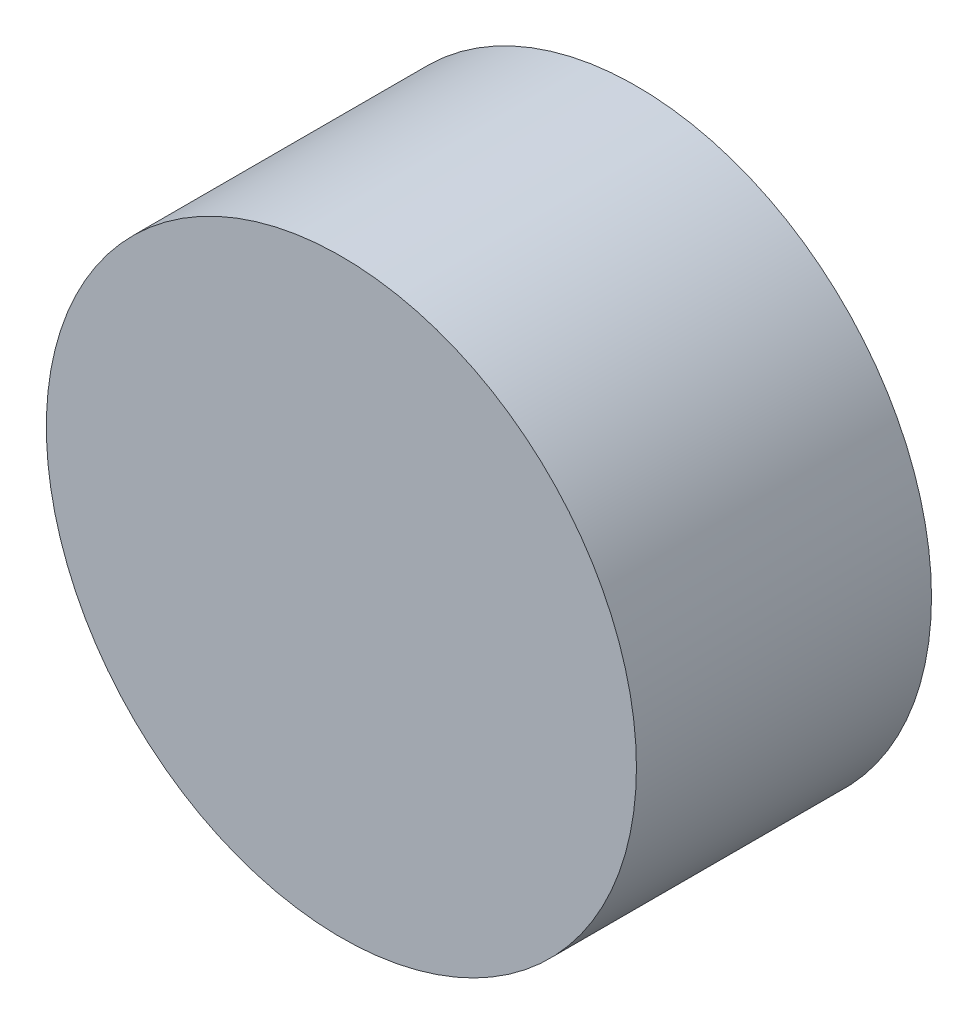
ISO-10303-21;
HEADER;
FILE_DESCRIPTION(('STEP AP214'),'2;1');
FILE_NAME('part.step','',(''),(''),'','','');
FILE_SCHEMA(('AUTOMOTIVE_DESIGN { 1 0 10303 214 1 1 1 1 }'));
ENDSEC;
DATA;
#1=APPLICATION_CONTEXT('core data for automotive mechanical design processes');
#2=APPLICATION_PROTOCOL_DEFINITION('international standard','automotive_design',2000,#1);
#3=PRODUCT_CONTEXT('',#1,'mechanical');
#4=PRODUCT('Part','Part','',(#3));
#5=PRODUCT_RELATED_PRODUCT_CATEGORY('part','',(#4));
#6=PRODUCT_DEFINITION_FORMATION('','',#4);
#7=PRODUCT_DEFINITION_CONTEXT('part definition',#1,'design');
#8=PRODUCT_DEFINITION('design','',#6,#7);
#9=PRODUCT_DEFINITION_SHAPE('','',#8);
#10=(LENGTH_UNIT() NAMED_UNIT(*) SI_UNIT(.MILLI.,.METRE.));
#11=(NAMED_UNIT(*) PLANE_ANGLE_UNIT() SI_UNIT($,.RADIAN.));
#12=(NAMED_UNIT(*) SI_UNIT($,.STERADIAN.) SOLID_ANGLE_UNIT());
#13=UNCERTAINTY_MEASURE_WITH_UNIT(LENGTH_MEASURE(1.E-05),#10,'distance_accuracy_value','');
#14=(GEOMETRIC_REPRESENTATION_CONTEXT(3) GLOBAL_UNCERTAINTY_ASSIGNED_CONTEXT((#13)) GLOBAL_UNIT_ASSIGNED_CONTEXT((#10,
#11,#12)) REPRESENTATION_CONTEXT('',''));
#15=CARTESIAN_POINT('',(0.,0.,0.));
#16=DIRECTION('',(0.,0.,1.));
#17=DIRECTION('',(1.,0.,0.));
#18=AXIS2_PLACEMENT_3D('',#15,#16,#17);
#19=CARTESIAN_POINT('',(-26.1308774653971,18.7712315969783,10.));
#20=DIRECTION('',(0.,0.,-1.));
#21=DIRECTION('',(-1.,0.,0.));
#22=AXIS2_PLACEMENT_3D('',#19,#20,#21);
#23=CYLINDRICAL_SURFACE('',#22,10.);
#24=CARTESIAN_POINT('',(-26.1308774653971,18.7712315969783,10.));
#25=DIRECTION('',(0.,0.,1.));
#26=DIRECTION('',(1.,0.,0.));
#27=AXIS2_PLACEMENT_3D('',#24,#25,#26);
#28=CIRCLE('',#27,10.);
#29=CARTESIAN_POINT('',(-16.1308774653971,18.7712315969783,10.));
#30=VERTEX_POINT('',#29);
#31=EDGE_CURVE('E10',#30,#30,#28,.T.);
#32=ORIENTED_EDGE('',*,*,#31,.F.);
#33=EDGE_LOOP('',(#32));
#34=FACE_BOUND('',#33,.T.);
#35=CARTESIAN_POINT('',(-26.1308774653971,18.7712315969783,0.));
#36=DIRECTION('',(0.,0.,1.));
#37=DIRECTION('',(1.,0.,0.));
#38=AXIS2_PLACEMENT_3D('',#35,#36,#37);
#39=CIRCLE('',#38,10.);
#40=CARTESIAN_POINT('',(-16.1308774653971,18.7712315969783,0.));
#41=VERTEX_POINT('',#40);
#42=EDGE_CURVE('E36',#41,#41,#39,.T.);
#43=ORIENTED_EDGE('',*,*,#42,.T.);
#44=EDGE_LOOP('',(#43));
#45=FACE_BOUND('',#44,.T.);
#46=ADVANCED_FACE('F33',(#34,#45),#23,.T.);
#47=CARTESIAN_POINT('',(-26.1308774653971,18.7712315969783,10.));
#48=DIRECTION('',(0.,0.,1.));
#49=DIRECTION('',(1.,0.,0.));
#50=AXIS2_PLACEMENT_3D('',#47,#48,#49);
#51=PLANE('',#50);
#52=ORIENTED_EDGE('',*,*,#31,.T.);
#53=EDGE_LOOP('',(#52));
#54=FACE_BOUND('',#53,.T.);
#55=ADVANCED_FACE('F48',(#54),#51,.T.);
#56=CARTESIAN_POINT('',(-26.1308774653971,18.7712315969783,0.));
#57=DIRECTION('',(0.,0.,1.));
#58=DIRECTION('',(1.,0.,0.));
#59=AXIS2_PLACEMENT_3D('',#56,#57,#58);
#60=PLANE('',#59);
#61=ORIENTED_EDGE('',*,*,#42,.F.);
#62=EDGE_LOOP('',(#61));
#63=FACE_BOUND('',#62,.T.);
#64=ADVANCED_FACE('F46',(#63),#60,.F.);
#65=CLOSED_SHELL('',(#46,#55,#64));
#66=MANIFOLD_SOLID_BREP('B2',#65);
#67=ADVANCED_BREP_SHAPE_REPRESENTATION('',(#18,#66),#14);
#68=SHAPE_DEFINITION_REPRESENTATION(#9,#67);
ENDSEC;
END-ISO-10303-21;
